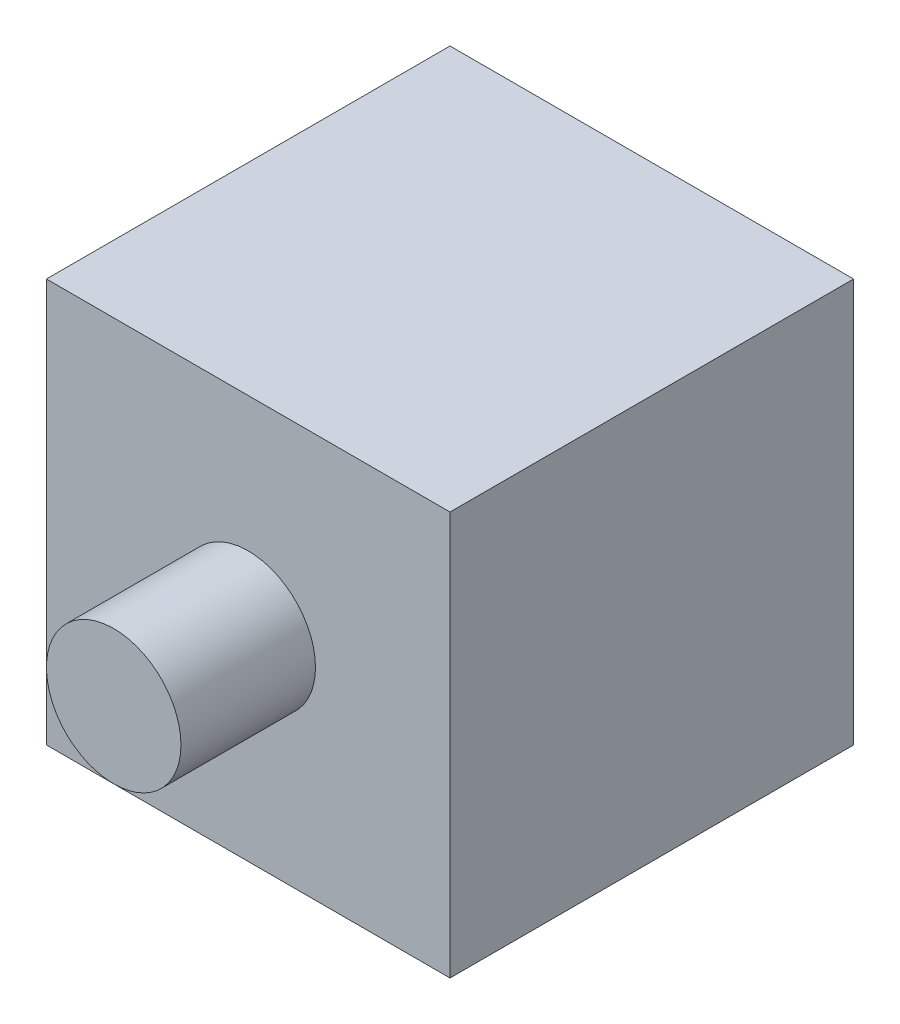
ISO-10303-21;
HEADER;
FILE_DESCRIPTION(('STEP AP214'),'2;1');
FILE_NAME('part.step','',(''),(''),'','','');
FILE_SCHEMA(('AUTOMOTIVE_DESIGN { 1 0 10303 214 1 1 1 1 }'));
ENDSEC;
DATA;
#1=APPLICATION_CONTEXT('core data for automotive mechanical design processes');
#2=APPLICATION_PROTOCOL_DEFINITION('international standard','automotive_design',2000,#1);
#3=PRODUCT_CONTEXT('',#1,'mechanical');
#4=PRODUCT('Part','Part','',(#3));
#5=PRODUCT_RELATED_PRODUCT_CATEGORY('part','',(#4));
#6=PRODUCT_DEFINITION_FORMATION('','',#4);
#7=PRODUCT_DEFINITION_CONTEXT('part definition',#1,'design');
#8=PRODUCT_DEFINITION('design','',#6,#7);
#9=PRODUCT_DEFINITION_SHAPE('','',#8);
#10=(LENGTH_UNIT() NAMED_UNIT(*) SI_UNIT(.MILLI.,.METRE.));
#11=(NAMED_UNIT(*) PLANE_ANGLE_UNIT() SI_UNIT($,.RADIAN.));
#12=(NAMED_UNIT(*) SI_UNIT($,.STERADIAN.) SOLID_ANGLE_UNIT());
#13=UNCERTAINTY_MEASURE_WITH_UNIT(LENGTH_MEASURE(1.E-05),#10,'distance_accuracy_value','');
#14=(GEOMETRIC_REPRESENTATION_CONTEXT(3) GLOBAL_UNCERTAINTY_ASSIGNED_CONTEXT((#13)) GLOBAL_UNIT_ASSIGNED_CONTEXT((#10,
#11,#12)) REPRESENTATION_CONTEXT('',''));
#15=CARTESIAN_POINT('',(0.,0.,0.));
#16=DIRECTION('',(0.,0.,1.));
#17=DIRECTION('',(1.,0.,0.));
#18=AXIS2_PLACEMENT_3D('',#15,#16,#17);
#19=CARTESIAN_POINT('',(15.,30.,-15.));
#20=DIRECTION('',(-1.,0.,0.));
#21=DIRECTION('',(0.,0.,1.));
#22=AXIS2_PLACEMENT_3D('',#19,#20,#21);
#23=PLANE('',#22);
#24=DIRECTION('',(0.,0.,-1.));
#25=VECTOR('',#24,1.);
#26=CARTESIAN_POINT('',(15.,0.,-15.));
#27=LINE('',#26,#25);
#28=CARTESIAN_POINT('',(15.,0.,15.));
#29=VERTEX_POINT('',#28);
#30=CARTESIAN_POINT('',(15.,0.,-15.));
#31=VERTEX_POINT('',#30);
#32=EDGE_CURVE('E98',#29,#31,#27,.T.);
#33=ORIENTED_EDGE('',*,*,#32,.T.);
#34=DIRECTION('',(0.,-1.,0.));
#35=VECTOR('',#34,1.);
#36=CARTESIAN_POINT('',(15.,30.,-15.));
#37=LINE('',#36,#35);
#38=CARTESIAN_POINT('',(15.,30.,-15.));
#39=VERTEX_POINT('',#38);
#40=EDGE_CURVE('E35',#39,#31,#37,.T.);
#41=ORIENTED_EDGE('',*,*,#40,.F.);
#42=DIRECTION('',(0.,0.,-1.));
#43=VECTOR('',#42,1.);
#44=CARTESIAN_POINT('',(15.,30.,-15.));
#45=LINE('',#44,#43);
#46=CARTESIAN_POINT('',(15.,30.,15.));
#47=VERTEX_POINT('',#46);
#48=EDGE_CURVE('E85',#47,#39,#45,.T.);
#49=ORIENTED_EDGE('',*,*,#48,.F.);
#50=DIRECTION('',(0.,-1.,0.));
#51=VECTOR('',#50,1.);
#52=CARTESIAN_POINT('',(15.,30.,15.));
#53=LINE('',#52,#51);
#54=EDGE_CURVE('E94',#47,#29,#53,.T.);
#55=ORIENTED_EDGE('',*,*,#54,.T.);
#56=EDGE_LOOP('',(#33,#41,#49,#55));
#57=FACE_BOUND('',#56,.T.);
#58=ADVANCED_FACE('F32',(#57),#23,.F.);
#59=CARTESIAN_POINT('',(-15.,30.,-15.));
#60=DIRECTION('',(0.,0.,1.));
#61=DIRECTION('',(1.,0.,0.));
#62=AXIS2_PLACEMENT_3D('',#59,#60,#61);
#63=PLANE('',#62);
#64=DIRECTION('',(-1.,0.,0.));
#65=VECTOR('',#64,1.);
#66=CARTESIAN_POINT('',(-15.,0.,-15.));
#67=LINE('',#66,#65);
#68=CARTESIAN_POINT('',(-15.,0.,-15.));
#69=VERTEX_POINT('',#68);
#70=EDGE_CURVE('E90',#31,#69,#67,.T.);
#71=ORIENTED_EDGE('',*,*,#70,.T.);
#72=DIRECTION('',(0.,-1.,0.));
#73=VECTOR('',#72,1.);
#74=CARTESIAN_POINT('',(-15.,30.,-15.));
#75=LINE('',#74,#73);
#76=CARTESIAN_POINT('',(-15.,30.,-15.));
#77=VERTEX_POINT('',#76);
#78=EDGE_CURVE('E88',#77,#69,#75,.T.);
#79=ORIENTED_EDGE('',*,*,#78,.F.);
#80=DIRECTION('',(-1.,0.,0.));
#81=VECTOR('',#80,1.);
#82=CARTESIAN_POINT('',(-15.,30.,-15.));
#83=LINE('',#82,#81);
#84=EDGE_CURVE('E80',#39,#77,#83,.T.);
#85=ORIENTED_EDGE('',*,*,#84,.F.);
#86=ORIENTED_EDGE('',*,*,#40,.T.);
#87=EDGE_LOOP('',(#71,#79,#85,#86));
#88=FACE_BOUND('',#87,.T.);
#89=ADVANCED_FACE('F89',(#88),#63,.F.);
#90=CARTESIAN_POINT('',(-15.,30.,-15.));
#91=DIRECTION('',(1.,0.,0.));
#92=DIRECTION('',(0.,0.,-1.));
#93=AXIS2_PLACEMENT_3D('',#90,#91,#92);
#94=PLANE('',#93);
#95=DIRECTION('',(0.,0.,1.));
#96=VECTOR('',#95,1.);
#97=CARTESIAN_POINT('',(-15.,0.,-15.));
#98=LINE('',#97,#96);
#99=CARTESIAN_POINT('',(-15.,0.,15.));
#100=VERTEX_POINT('',#99);
#101=EDGE_CURVE('E66',#69,#100,#98,.T.);
#102=ORIENTED_EDGE('',*,*,#101,.T.);
#103=DIRECTION('',(0.,-1.,0.));
#104=VECTOR('',#103,1.);
#105=CARTESIAN_POINT('',(-15.,30.,15.));
#106=LINE('',#105,#104);
#107=CARTESIAN_POINT('',(-15.,30.,15.));
#108=VERTEX_POINT('',#107);
#109=EDGE_CURVE('E91',#108,#100,#106,.T.);
#110=ORIENTED_EDGE('',*,*,#109,.F.);
#111=DIRECTION('',(0.,0.,1.));
#112=VECTOR('',#111,1.);
#113=CARTESIAN_POINT('',(-15.,30.,-15.));
#114=LINE('',#113,#112);
#115=EDGE_CURVE('E83',#77,#108,#114,.T.);
#116=ORIENTED_EDGE('',*,*,#115,.F.);
#117=ORIENTED_EDGE('',*,*,#78,.T.);
#118=EDGE_LOOP('',(#102,#110,#116,#117));
#119=FACE_BOUND('',#118,.T.);
#120=ADVANCED_FACE('F92',(#119),#94,.F.);
#121=CARTESIAN_POINT('',(-15.,30.,15.));
#122=DIRECTION('',(0.,0.,-1.));
#123=DIRECTION('',(-1.,0.,0.));
#124=AXIS2_PLACEMENT_3D('',#121,#122,#123);
#125=PLANE('',#124);
#126=CARTESIAN_POINT('',(0.,15.,15.));
#127=DIRECTION('',(0.,0.,1.));
#128=DIRECTION('',(1.,0.,0.));
#129=AXIS2_PLACEMENT_3D('',#126,#127,#128);
#130=CIRCLE('',#129,5.);
#131=CARTESIAN_POINT('',(5.00000000000001,15.,15.));
#132=VERTEX_POINT('',#131);
#133=EDGE_CURVE('E11',#132,#132,#130,.T.);
#134=ORIENTED_EDGE('',*,*,#133,.F.);
#135=EDGE_LOOP('',(#134));
#136=FACE_BOUND('',#135,.T.);
#137=DIRECTION('',(1.,0.,0.));
#138=VECTOR('',#137,1.);
#139=CARTESIAN_POINT('',(-15.,0.,15.));
#140=LINE('',#139,#138);
#141=EDGE_CURVE('E72',#100,#29,#140,.T.);
#142=ORIENTED_EDGE('',*,*,#141,.T.);
#143=ORIENTED_EDGE('',*,*,#54,.F.);
#144=DIRECTION('',(1.,0.,0.));
#145=VECTOR('',#144,1.);
#146=CARTESIAN_POINT('',(-15.,30.,15.));
#147=LINE('',#146,#145);
#148=EDGE_CURVE('E49',#108,#47,#147,.T.);
#149=ORIENTED_EDGE('',*,*,#148,.F.);
#150=ORIENTED_EDGE('',*,*,#109,.T.);
#151=EDGE_LOOP('',(#142,#143,#149,#150));
#152=FACE_BOUND('',#151,.T.);
#153=ADVANCED_FACE('F106',(#136,#152),#125,.F.);
#154=CARTESIAN_POINT('',(0.,30.,0.));
#155=DIRECTION('',(0.,1.,0.));
#156=DIRECTION('',(0.,0.,1.));
#157=AXIS2_PLACEMENT_3D('',#154,#155,#156);
#158=PLANE('',#157);
#159=ORIENTED_EDGE('',*,*,#48,.T.);
#160=ORIENTED_EDGE('',*,*,#84,.T.);
#161=ORIENTED_EDGE('',*,*,#115,.T.);
#162=ORIENTED_EDGE('',*,*,#148,.T.);
#163=EDGE_LOOP('',(#159,#160,#161,#162));
#164=FACE_BOUND('',#163,.T.);
#165=ADVANCED_FACE('F81',(#164),#158,.T.);
#166=CARTESIAN_POINT('',(0.,0.,0.));
#167=DIRECTION('',(0.,1.,0.));
#168=DIRECTION('',(0.,0.,1.));
#169=AXIS2_PLACEMENT_3D('',#166,#167,#168);
#170=PLANE('',#169);
#171=ORIENTED_EDGE('',*,*,#32,.F.);
#172=ORIENTED_EDGE('',*,*,#141,.F.);
#173=ORIENTED_EDGE('',*,*,#101,.F.);
#174=ORIENTED_EDGE('',*,*,#70,.F.);
#175=EDGE_LOOP('',(#171,#172,#173,#174));
#176=FACE_BOUND('',#175,.T.);
#177=ADVANCED_FACE('F109',(#176),#170,.F.);
#178=CARTESIAN_POINT('',(0.,15.,25.));
#179=DIRECTION('',(0.,0.,-1.));
#180=DIRECTION('',(-1.,0.,0.));
#181=AXIS2_PLACEMENT_3D('',#178,#179,#180);
#182=CYLINDRICAL_SURFACE('',#181,5.);
#183=CARTESIAN_POINT('',(0.,15.,25.));
#184=DIRECTION('',(0.,0.,1.));
#185=DIRECTION('',(1.,0.,0.));
#186=AXIS2_PLACEMENT_3D('',#183,#184,#185);
#187=CIRCLE('',#186,5.);
#188=CARTESIAN_POINT('',(5.00000000000001,15.,25.));
#189=VERTEX_POINT('',#188);
#190=EDGE_CURVE('E101',#189,#189,#187,.T.);
#191=ORIENTED_EDGE('',*,*,#190,.F.);
#192=EDGE_LOOP('',(#191));
#193=FACE_BOUND('',#192,.T.);
#194=ORIENTED_EDGE('',*,*,#133,.T.);
#195=EDGE_LOOP('',(#194));
#196=FACE_BOUND('',#195,.T.);
#197=ADVANCED_FACE('F117',(#193,#196),#182,.T.);
#198=CARTESIAN_POINT('',(0.,15.,25.));
#199=DIRECTION('',(0.,0.,1.));
#200=DIRECTION('',(1.,0.,0.));
#201=AXIS2_PLACEMENT_3D('',#198,#199,#200);
#202=PLANE('',#201);
#203=ORIENTED_EDGE('',*,*,#190,.T.);
#204=EDGE_LOOP('',(#203));
#205=FACE_BOUND('',#204,.T.);
#206=ADVANCED_FACE('F115',(#205),#202,.T.);
#207=CLOSED_SHELL('',(#58,#89,#120,#153,#165,#177,#197,#206));
#208=MANIFOLD_SOLID_BREP('B2',#207);
#209=ADVANCED_BREP_SHAPE_REPRESENTATION('',(#18,#208),#14);
#210=SHAPE_DEFINITION_REPRESENTATION(#9,#209);
ENDSEC;
END-ISO-10303-21;
